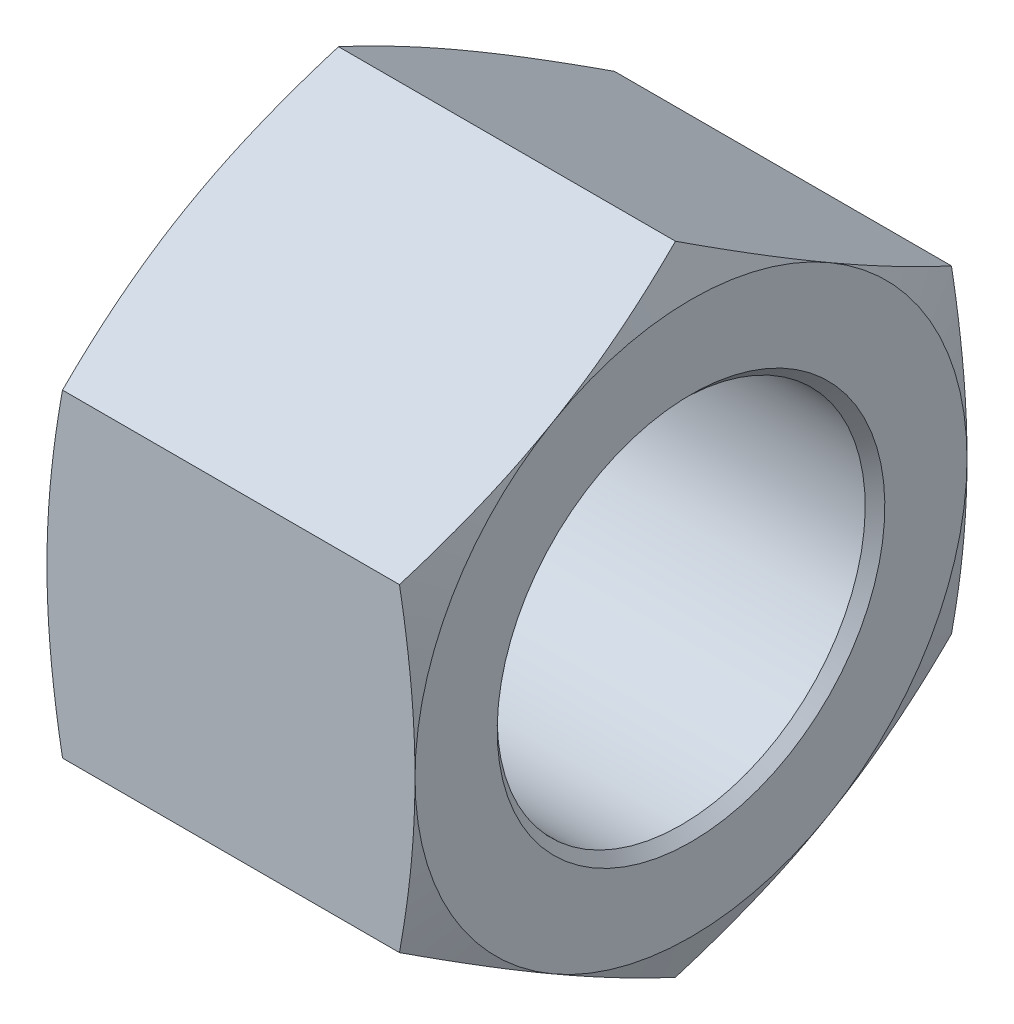
ISO-10303-21;
HEADER;
FILE_DESCRIPTION(('STEP AP214'),'2;1');
FILE_NAME('part.step','',(''),(''),'','','');
FILE_SCHEMA(('AUTOMOTIVE_DESIGN { 1 0 10303 214 1 1 1 1 }'));
ENDSEC;
DATA;
#1=APPLICATION_CONTEXT('core data for automotive mechanical design processes');
#2=APPLICATION_PROTOCOL_DEFINITION('international standard','automotive_design',2000,#1);
#3=PRODUCT_CONTEXT('',#1,'mechanical');
#4=PRODUCT('Part','Part','',(#3));
#5=PRODUCT_RELATED_PRODUCT_CATEGORY('part','',(#4));
#6=PRODUCT_DEFINITION_FORMATION('','',#4);
#7=PRODUCT_DEFINITION_CONTEXT('part definition',#1,'design');
#8=PRODUCT_DEFINITION('design','',#6,#7);
#9=PRODUCT_DEFINITION_SHAPE('','',#8);
#10=(LENGTH_UNIT() NAMED_UNIT(*) SI_UNIT(.MILLI.,.METRE.));
#11=(NAMED_UNIT(*) PLANE_ANGLE_UNIT() SI_UNIT($,.RADIAN.));
#12=(NAMED_UNIT(*) SI_UNIT($,.STERADIAN.) SOLID_ANGLE_UNIT());
#13=UNCERTAINTY_MEASURE_WITH_UNIT(LENGTH_MEASURE(1.E-05),#10,'distance_accuracy_value','');
#14=(GEOMETRIC_REPRESENTATION_CONTEXT(3) GLOBAL_UNCERTAINTY_ASSIGNED_CONTEXT((#13)) GLOBAL_UNIT_ASSIGNED_CONTEXT((#10,
#11,#12)) REPRESENTATION_CONTEXT('',''));
#15=CARTESIAN_POINT('',(0.,0.,0.));
#16=DIRECTION('',(0.,0.,1.));
#17=DIRECTION('',(1.,0.,0.));
#18=AXIS2_PLACEMENT_3D('',#15,#16,#17);
#19=CARTESIAN_POINT('',(9.525,4.12444598552339,-7.14375));
#20=DIRECTION('',(0.,-0.866025403784439,0.5));
#21=DIRECTION('',(0.,-0.5,-0.866025403784439));
#22=AXIS2_PLACEMENT_3D('',#19,#20,#21);
#23=PLANE('',#22);
#24=CARTESIAN_POINT('',(9.1227191893557,4.12433051546956,-7.14394999999999));
#25=CARTESIAN_POINT('',(9.1849126824642,4.29514240702871,-6.84809512528259));
#26=CARTESIAN_POINT('',(9.24148841339753,4.46651756023661,-6.55126465277161));
#27=CARTESIAN_POINT('',(9.34102464055038,4.81038215894262,-5.95567369688851));
#28=CARTESIAN_POINT('',(9.38397448286102,4.98287236929968,-5.65691188874185));
#29=CARTESIAN_POINT('',(9.45344461581565,5.32705284845922,-5.06077381186412));
#30=CARTESIAN_POINT('',(9.48011643058988,5.49873525708066,-4.76341115736598));
#31=CARTESIAN_POINT('',(9.51589082873939,5.84250155309196,-4.16799046674465));
#32=CARTESIAN_POINT('',(9.525,6.01458526568852,-3.86993273337232));
#33=CARTESIAN_POINT('',(9.525,6.35875269088165,-3.27381726662767));
#34=CARTESIAN_POINT('',(9.51589082873939,6.53083640347821,-2.97575953325535));
#35=CARTESIAN_POINT('',(9.48011643058988,6.87460269948951,-2.38033884263402));
#36=CARTESIAN_POINT('',(9.45344461581565,7.04628510811095,-2.08297618813587));
#37=CARTESIAN_POINT('',(9.38397448286102,7.39046558727049,-1.48683811125815));
#38=CARTESIAN_POINT('',(9.34102464055037,7.56295579762755,-1.18807630311148));
#39=CARTESIAN_POINT('',(9.24148841339753,7.90682039633356,-0.592485347228383));
#40=CARTESIAN_POINT('',(9.1849126824642,8.07819554954146,-0.295654874717405));
#41=CARTESIAN_POINT('',(9.12271918935569,8.24900744110061,0.000199999999997878));
#42=B_SPLINE_CURVE_WITH_KNOTS('',3,(#24,#25,#26,#27,#28,#29,#30,#31,#32,#33,#34,#35,#36,#37,#38,
#39,#40,#41),.UNSPECIFIED.,.F.,.F.,(4,2,2,2,2,2,2,2,4),(0.,1.04182409365374,2.08446078007893,
3.11723784735874,4.14962743643147,5.18201702550421,6.21479409278402,7.25743077920921,
8.29925487286295),.UNSPECIFIED.);
#43=CARTESIAN_POINT('',(9.1227612179007,4.1244459855234,-7.14375));
#44=VERTEX_POINT('',#43);
#45=CARTESIAN_POINT('',(9.525,6.18666897828508,-3.571875));
#46=VERTEX_POINT('',#45);
#47=EDGE_CURVE('E304',#44,#46,#42,.T.);
#48=ORIENTED_EDGE('',*,*,#47,.F.);
#49=DIRECTION('',(-1.,0.,0.));
#50=VECTOR('',#49,1.);
#51=CARTESIAN_POINT('',(9.525,4.12444598552339,-7.14375));
#52=LINE('',#51,#50);
#53=CARTESIAN_POINT('',(0.402238782099302,4.12444598552339,-7.14375));
#54=VERTEX_POINT('',#53);
#55=EDGE_CURVE('E322',#44,#54,#52,.T.);
#56=ORIENTED_EDGE('',*,*,#55,.T.);
#57=CARTESIAN_POINT('',(0.402280810644305,8.24900744110061,0.000199999999998162));
#58=CARTESIAN_POINT('',(0.340087317535802,8.07819554954146,-0.295654874717404));
#59=CARTESIAN_POINT('',(0.283511586602467,7.90682039633356,-0.592485347228383));
#60=CARTESIAN_POINT('',(0.183975359449624,7.56295579762755,-1.18807630311148));
#61=CARTESIAN_POINT('',(0.141025517138983,7.39046558727049,-1.48683811125815));
#62=CARTESIAN_POINT('',(0.0715553841843504,7.04628510811095,-2.08297618813587));
#63=CARTESIAN_POINT('',(0.044883569410118,6.87460269948951,-2.38033884263402));
#64=CARTESIAN_POINT('',(0.00910917126060439,6.53083640347821,-2.97575953325535));
#65=CARTESIAN_POINT('',(0.,6.35875269088165,-3.27381726662767));
#66=CARTESIAN_POINT('',(0.,6.01458526568852,-3.86993273337232));
#67=CARTESIAN_POINT('',(0.00910917126060452,5.84250155309196,-4.16799046674465));
#68=CARTESIAN_POINT('',(0.0448835694101182,5.49873525708066,-4.76341115736598));
#69=CARTESIAN_POINT('',(0.0715553841843507,5.32705284845922,-5.06077381186412));
#70=CARTESIAN_POINT('',(0.141025517138984,4.98287236929968,-5.65691188874185));
#71=CARTESIAN_POINT('',(0.183975359449625,4.81038215894262,-5.95567369688851));
#72=CARTESIAN_POINT('',(0.283511586602467,4.46651756023661,-6.55126465277161));
#73=CARTESIAN_POINT('',(0.340087317535802,4.29514240702871,-6.84809512528259));
#74=CARTESIAN_POINT('',(0.402280810644306,4.12433051546956,-7.14394999999999));
#75=B_SPLINE_CURVE_WITH_KNOTS('',3,(#57,#58,#59,#60,#61,#62,#63,#64,#65,#66,#67,#68,#69,#70,#71,
#72,#73,#74),.UNSPECIFIED.,.F.,.F.,(4,2,2,2,2,2,2,2,4),(0.,1.04182409365374,2.08446078007893,
3.11723784735874,4.14962743643147,5.18201702550421,6.21479409278402,7.25743077920921,
8.29925487286295),.UNSPECIFIED.);
#76=CARTESIAN_POINT('',(0.,6.18666897828508,-3.571875));
#77=VERTEX_POINT('',#76);
#78=EDGE_CURVE('E257',#77,#54,#75,.T.);
#79=ORIENTED_EDGE('',*,*,#78,.F.);
#80=CARTESIAN_POINT('',(0.4022387820993,8.24889197104678,0.));
#81=VERTEX_POINT('',#80);
#82=EDGE_CURVE('E261',#81,#77,#75,.T.);
#83=ORIENTED_EDGE('',*,*,#82,.F.);
#84=DIRECTION('',(-1.,0.,0.));
#85=VECTOR('',#84,1.);
#86=CARTESIAN_POINT('',(9.525,8.24889197104678,0.));
#87=LINE('',#86,#85);
#88=CARTESIAN_POINT('',(9.1227612179007,8.24889197104678,0.));
#89=VERTEX_POINT('',#88);
#90=EDGE_CURVE('E294',#89,#81,#87,.T.);
#91=ORIENTED_EDGE('',*,*,#90,.F.);
#92=EDGE_CURVE('E202',#46,#89,#42,.T.);
#93=ORIENTED_EDGE('',*,*,#92,.F.);
#94=EDGE_LOOP('',(#48,#56,#79,#83,#91,#93));
#95=FACE_BOUND('',#94,.T.);
#96=ADVANCED_FACE('F33',(#95),#23,.F.);
#97=CARTESIAN_POINT('',(9.525,8.24889197104678,0.));
#98=DIRECTION('',(0.,-0.866025403784439,-0.5));
#99=DIRECTION('',(0.,0.5,-0.866025403784439));
#100=AXIS2_PLACEMENT_3D('',#97,#98,#99);
#101=PLANE('',#100);
#102=CARTESIAN_POINT('',(9.12271918935569,8.24900744110062,-0.000200000000001627));
#103=CARTESIAN_POINT('',(9.1849126824642,8.07819554954146,0.295654874717401));
#104=CARTESIAN_POINT('',(9.24148841339753,7.90682039633356,0.592485347228381));
#105=CARTESIAN_POINT('',(9.34102464055037,7.56295579762755,1.18807630311148));
#106=CARTESIAN_POINT('',(9.38397448286102,7.39046558727049,1.48683811125814));
#107=CARTESIAN_POINT('',(9.45344461581565,7.04628510811095,2.08297618813587));
#108=CARTESIAN_POINT('',(9.48011643058988,6.87460269948951,2.38033884263402));
#109=CARTESIAN_POINT('',(9.51589082873939,6.53083640347821,2.97575953325535));
#110=CARTESIAN_POINT('',(9.525,6.35875269088165,3.27381726662767));
#111=CARTESIAN_POINT('',(9.525,6.01458526568852,3.86993273337233));
#112=CARTESIAN_POINT('',(9.51589082873939,5.84250155309196,4.16799046674465));
#113=CARTESIAN_POINT('',(9.48011643058988,5.49873525708066,4.76341115736598));
#114=CARTESIAN_POINT('',(9.45344461581565,5.32705284845922,5.06077381186413));
#115=CARTESIAN_POINT('',(9.38397448286102,4.98287236929967,5.65691188874186));
#116=CARTESIAN_POINT('',(9.34102464055037,4.81038215894262,5.95567369688852));
#117=CARTESIAN_POINT('',(9.24148841339753,4.46651756023661,6.55126465277162));
#118=CARTESIAN_POINT('',(9.1849126824642,4.29514240702871,6.8480951252826));
#119=CARTESIAN_POINT('',(9.12271918935569,4.12433051546955,7.14395));
#120=B_SPLINE_CURVE_WITH_KNOTS('',3,(#102,#103,#104,#105,#106,#107,#108,#109,#110,#111,#112,
#113,#114,#115,#116,#117,#118,#119),.UNSPECIFIED.,.F.,.F.,(4,2,2,2,2,2,2,2,4),(0.,
1.04182409365374,2.08446078007893,3.11723784735874,4.14962743643148,5.18201702550422,
6.21479409278403,7.25743077920922,8.29925487286296),.UNSPECIFIED.);
#121=CARTESIAN_POINT('',(9.525,6.18666897828509,3.57187499999999));
#122=VERTEX_POINT('',#121);
#123=EDGE_CURVE('E200',#89,#122,#120,.T.);
#124=ORIENTED_EDGE('',*,*,#123,.F.);
#125=ORIENTED_EDGE('',*,*,#90,.T.);
#126=CARTESIAN_POINT('',(0.402280810644308,4.12433051546955,7.14395));
#127=CARTESIAN_POINT('',(0.340087317535804,4.29514240702871,6.8480951252826));
#128=CARTESIAN_POINT('',(0.283511586602469,4.46651756023661,6.55126465277162));
#129=CARTESIAN_POINT('',(0.183975359449626,4.81038215894262,5.95567369688852));
#130=CARTESIAN_POINT('',(0.141025517138984,4.98287236929967,5.65691188874186));
#131=CARTESIAN_POINT('',(0.071555384184351,5.32705284845922,5.06077381186413));
#132=CARTESIAN_POINT('',(0.0448835694101186,5.49873525708066,4.76341115736598));
#133=CARTESIAN_POINT('',(0.00910917126060477,5.84250155309196,4.16799046674465));
#134=CARTESIAN_POINT('',(0.,6.01458526568852,3.86993273337233));
#135=CARTESIAN_POINT('',(0.,6.35875269088165,3.27381726662767));
#136=CARTESIAN_POINT('',(0.00910917126060422,6.53083640347821,2.97575953325535));
#137=CARTESIAN_POINT('',(0.0448835694101178,6.87460269948951,2.38033884263402));
#138=CARTESIAN_POINT('',(0.0715553841843502,7.04628510811095,2.08297618813587));
#139=CARTESIAN_POINT('',(0.141025517138983,7.39046558727049,1.48683811125814));
#140=CARTESIAN_POINT('',(0.183975359449624,7.56295579762755,1.18807630311148));
#141=CARTESIAN_POINT('',(0.283511586602467,7.90682039633356,0.59248534722838));
#142=CARTESIAN_POINT('',(0.340087317535802,8.07819554954146,0.295654874717401));
#143=CARTESIAN_POINT('',(0.402280810644306,8.24900744110062,-0.000200000000002111));
#144=B_SPLINE_CURVE_WITH_KNOTS('',3,(#126,#127,#128,#129,#130,#131,#132,#133,#134,#135,#136,
#137,#138,#139,#140,#141,#142,#143),.UNSPECIFIED.,.F.,.F.,(4,2,2,2,2,2,2,2,4),(0.,
1.04182409365374,2.08446078007893,3.11723784735874,4.14962743643148,5.18201702550422,
6.21479409278403,7.25743077920922,8.29925487286296),.UNSPECIFIED.);
#145=CARTESIAN_POINT('',(0.,6.18666897828509,3.571875));
#146=VERTEX_POINT('',#145);
#147=EDGE_CURVE('E215',#146,#81,#144,.T.);
#148=ORIENTED_EDGE('',*,*,#147,.F.);
#149=CARTESIAN_POINT('',(0.402238782099302,4.12444598552338,7.14375));
#150=VERTEX_POINT('',#149);
#151=EDGE_CURVE('E222',#150,#146,#144,.T.);
#152=ORIENTED_EDGE('',*,*,#151,.F.);
#153=DIRECTION('',(-1.,0.,0.));
#154=VECTOR('',#153,1.);
#155=CARTESIAN_POINT('',(9.525,4.12444598552339,7.14375));
#156=LINE('',#155,#154);
#157=CARTESIAN_POINT('',(9.1227612179007,4.12444598552338,7.14375));
#158=VERTEX_POINT('',#157);
#159=EDGE_CURVE('E314',#158,#150,#156,.T.);
#160=ORIENTED_EDGE('',*,*,#159,.F.);
#161=EDGE_CURVE('E196',#122,#158,#120,.T.);
#162=ORIENTED_EDGE('',*,*,#161,.F.);
#163=EDGE_LOOP('',(#124,#125,#148,#152,#160,#162));
#164=FACE_BOUND('',#163,.T.);
#165=ADVANCED_FACE('F207',(#164),#101,.F.);
#166=CARTESIAN_POINT('',(9.525,4.12444598552339,7.14375));
#167=DIRECTION('',(0.,0.,-1.));
#168=DIRECTION('',(-1.,0.,0.));
#169=AXIS2_PLACEMENT_3D('',#166,#167,#168);
#170=PLANE('',#169);
#171=CARTESIAN_POINT('',(7.3755954676901,-10.9200827147679,7.14375));
#172=CARTESIAN_POINT('',(7.47401251114615,-10.5968736314427,7.14375));
#173=CARTESIAN_POINT('',(7.57128115583758,-10.2733083598642,7.14375));
#174=CARTESIAN_POINT('',(7.76288635518501,-9.62528410275324,7.14375));
#175=CARTESIAN_POINT('',(7.85722267782338,-9.30082504870096,7.14375));
#176=CARTESIAN_POINT('',(8.0424848681459,-8.65027654273222,7.14375));
#177=CARTESIAN_POINT('',(8.13340404438387,-8.32418517835007,7.14375));
#178=CARTESIAN_POINT('',(8.31076752613789,-7.6707894265508,7.14375));
#179=CARTESIAN_POINT('',(8.39721191199983,-7.34348506102655,7.14375));
#180=CARTESIAN_POINT('',(8.56348618493307,-6.69148973208795,7.14375));
#181=CARTESIAN_POINT('',(8.6433844844259,-6.36681630234357,7.14375));
#182=CARTESIAN_POINT('',(8.79637870102756,-5.71585382602452,7.14375));
#183=CARTESIAN_POINT('',(8.86947450366048,-5.38956475235824,7.14375));
#184=CARTESIAN_POINT('',(9.00715956615598,-4.73529797771662,7.14375));
#185=CARTESIAN_POINT('',(9.07175172771729,-4.40732089264437,7.14375));
#186=CARTESIAN_POINT('',(9.19046269714445,-3.74946258820886,7.14375));
#187=CARTESIAN_POINT('',(9.24458185591649,-3.41958143302449,7.14375));
#188=CARTESIAN_POINT('',(9.33478964865835,-2.79506090172699,7.14375));
#189=CARTESIAN_POINT('',(9.37221953324854,-2.50061708178008,7.14375));
#190=CARTESIAN_POINT('',(9.43557941092575,-1.91048438735558,7.14375));
#191=CARTESIAN_POINT('',(9.46150973912172,-1.61479554941263,7.14375));
#192=CARTESIAN_POINT('',(9.5006217524448,-1.02277258498837,7.14375));
#193=CARTESIAN_POINT('',(9.51381245487754,-0.726439063946467,7.14375));
#194=CARTESIAN_POINT('',(9.52677737403611,-0.13347554661258,7.14375));
#195=CARTESIAN_POINT('',(9.5265516855081,0.163154447570928,7.14375));
#196=CARTESIAN_POINT('',(9.51266094939001,0.757599550813985,7.14375));
#197=CARTESIAN_POINT('',(9.49892774984047,1.05541304081946,7.14375));
#198=CARTESIAN_POINT('',(9.45865399683557,1.65016526826794,7.14375));
#199=CARTESIAN_POINT('',(9.43211313568459,1.94710398452264,7.14375));
#200=CARTESIAN_POINT('',(9.36746562869702,2.53996004102374,7.14375));
#201=CARTESIAN_POINT('',(9.3293490488025,2.83587628232483,7.14375));
#202=CARTESIAN_POINT('',(9.24309621441296,3.42622836693684,7.14375));
#203=CARTESIAN_POINT('',(9.19495990621529,3.72066420230458,7.14375));
#204=CARTESIAN_POINT('',(9.08746427609924,4.32354944457742,7.14375));
#205=CARTESIAN_POINT('',(9.02764598697369,4.63191628737276,7.14375));
#206=CARTESIAN_POINT('',(8.90031041281534,5.24706642900888,7.14375));
#207=CARTESIAN_POINT('',(8.83279254734769,5.55384960663995,7.14375));
#208=CARTESIAN_POINT('',(8.69147566748789,6.16605106932829,7.14375));
#209=CARTESIAN_POINT('',(8.61767482891231,6.47146893070712,7.14375));
#210=CARTESIAN_POINT('',(8.46499211916294,7.08101794740676,7.14375));
#211=CARTESIAN_POINT('',(8.38611036977709,7.38514913338272,7.14375));
#212=CARTESIAN_POINT('',(8.22411351250143,7.9926947026574,7.14375));
#213=CARTESIAN_POINT('',(8.14099311918675,8.29610767165621,7.14375));
#214=CARTESIAN_POINT('',(7.97136566457326,8.90198721551974,7.14375));
#215=CARTESIAN_POINT('',(7.88485855340292,9.20445377637713,7.14375));
#216=CARTESIAN_POINT('',(7.62122854002771,10.1105383213636,7.14375));
#217=CARTESIAN_POINT('',(7.4399670672183,10.7129513695015,7.14375));
#218=CARTESIAN_POINT('',(7.07192148188703,11.9087936075579,7.14375));
#219=CARTESIAN_POINT('',(6.88522041109715,12.5022485655621,7.14375));
#220=CARTESIAN_POINT('',(6.50651407512142,13.6874914933361,7.14375));
#221=CARTESIAN_POINT('',(6.3145085554472,14.2792793816195,7.14375));
#222=CARTESIAN_POINT('',(5.92735695069108,15.459337282081,7.14375));
#223=CARTESIAN_POINT('',(5.73222554627461,16.0476121223004,7.14375));
#224=CARTESIAN_POINT('',(5.43736295643888,16.9292722585656,7.14375));
#225=CARTESIAN_POINT('',(5.33871852988799,17.2230217987937,7.14375));
#226=CARTESIAN_POINT('',(5.1407913796115,17.8103049969963,7.14375));
#227=CARTESIAN_POINT('',(5.04150865744177,18.1038386554951,7.14375));
#228=CARTESIAN_POINT('',(4.94194957334921,18.3972785363047,7.14375));
#229=B_SPLINE_CURVE_WITH_KNOTS('',3,(#171,#172,#173,#174,#175,#176,#177,#178,#179,#180,#181,
#182,#183,#184,#185,#186,#187,#188,#189,#190,#191,#192,#193,#194,#195,#196,#197,#198,#199,#200,
#201,#202,#203,#204,#205,#206,#207,#208,#209,#210,#211,#212,#213,#214,#215,#216,#217,#218,#219,
#220,#221,#222,#223,#224,#225,#226,#227,#228),.UNSPECIFIED.,.F.,.F.,(4,2,2,2,2,2,2,2,2,2,2,2,2,
2,2,2,2,2,2,2,2,2,2,2,2,2,2,2,4),(0.,1.01359005049056,2.02726009738559,3.04282139996046,
4.05836446156959,5.06138639910424,6.0644252129549,7.06712086765491,8.06978292043059,
8.96002745474091,9.85024604470128,10.7398340612719,11.629415795599,12.5235090473126,
13.4176237800953,14.3125080035893,15.2073970235093,16.1496220096912,17.0919180727965,
18.0344886590554,18.9770366605774,19.920790180374,20.8645576027592,22.7517499572862,
24.6181117995847,26.484563339238,28.3439329328648,29.2735428384815,30.2031504789955),.UNSPECIFIED.);
#230=CARTESIAN_POINT('',(9.525,0.,7.14375));
#231=VERTEX_POINT('',#230);
#232=EDGE_CURVE('E201',#158,#231,#229,.F.);
#233=ORIENTED_EDGE('',*,*,#232,.F.);
#234=ORIENTED_EDGE('',*,*,#159,.T.);
#235=CARTESIAN_POINT('',(2.14940453230992,-10.9200827147679,7.14375));
#236=CARTESIAN_POINT('',(2.05098748885386,-10.5968736314427,7.14375));
#237=CARTESIAN_POINT('',(1.95371884416244,-10.2733083598642,7.14375));
#238=CARTESIAN_POINT('',(1.762113644815,-9.62528410275323,7.14375));
#239=CARTESIAN_POINT('',(1.66777732217663,-9.30082504870096,7.14375));
#240=CARTESIAN_POINT('',(1.48251513185412,-8.65027654273222,7.14375));
#241=CARTESIAN_POINT('',(1.39159595561614,-8.32418517835007,7.14375));
#242=CARTESIAN_POINT('',(1.21423247386212,-7.6707894265508,7.14375));
#243=CARTESIAN_POINT('',(1.12778808800018,-7.34348506102655,7.14375));
#244=CARTESIAN_POINT('',(0.961513815066938,-6.69148973208795,7.14375));
#245=CARTESIAN_POINT('',(0.881615515574106,-6.36681630234357,7.14375));
#246=CARTESIAN_POINT('',(0.72862129897245,-5.71585382602452,7.14375));
#247=CARTESIAN_POINT('',(0.655525496339531,-5.38956475235824,7.14375));
#248=CARTESIAN_POINT('',(0.517840433844024,-4.73529797771661,7.14375));
#249=CARTESIAN_POINT('',(0.453248272282719,-4.40732089264436,7.14375));
#250=CARTESIAN_POINT('',(0.334537302855556,-3.74946258820885,7.14375));
#251=CARTESIAN_POINT('',(0.280418144083515,-3.41958143302448,7.14375));
#252=CARTESIAN_POINT('',(0.190210351341649,-2.79506090172699,7.14375));
#253=CARTESIAN_POINT('',(0.152780466751466,-2.50061708178008,7.14375));
#254=CARTESIAN_POINT('',(0.0894205890742566,-1.91048438735558,7.14375));
#255=CARTESIAN_POINT('',(0.0634902608782825,-1.61479554941263,7.14375));
#256=CARTESIAN_POINT('',(0.0243782475552002,-1.02277258498837,7.14375));
#257=CARTESIAN_POINT('',(0.0111875451224659,-0.72643906394647,7.14375));
#258=CARTESIAN_POINT('',(-0.00177737403610836,-0.133475546612586,7.14375));
#259=CARTESIAN_POINT('',(-0.00155168550810396,0.163154447570921,7.14375));
#260=CARTESIAN_POINT('',(0.0123390506099932,0.757599550813975,7.14375));
#261=CARTESIAN_POINT('',(0.0260722501595279,1.05541304081945,7.14375));
#262=CARTESIAN_POINT('',(0.0663460031644316,1.65016526826792,7.14375));
#263=CARTESIAN_POINT('',(0.0928868643154085,1.94710398452262,7.14375));
#264=CARTESIAN_POINT('',(0.157534371302983,2.53996004102372,7.14375));
#265=CARTESIAN_POINT('',(0.1956509511975,2.83587628232481,7.14375));
#266=CARTESIAN_POINT('',(0.281903785587038,3.42622836693682,7.14375));
#267=CARTESIAN_POINT('',(0.330040093784703,3.72066420230456,7.14375));
#268=CARTESIAN_POINT('',(0.437535723900757,4.32354944457739,7.14375));
#269=CARTESIAN_POINT('',(0.497354013026304,4.63191628737274,7.14375));
#270=CARTESIAN_POINT('',(0.624689587184656,5.24706642900885,7.14375));
#271=CARTESIAN_POINT('',(0.692207452652307,5.55384960663992,7.14375));
#272=CARTESIAN_POINT('',(0.833524332512108,6.16605106932826,7.14375));
#273=CARTESIAN_POINT('',(0.907325171087688,6.47146893070709,7.14375));
#274=CARTESIAN_POINT('',(1.06000788083705,7.08101794740673,7.14375));
#275=CARTESIAN_POINT('',(1.1388896302229,7.38514913338269,7.14375));
#276=CARTESIAN_POINT('',(1.30088648749856,7.99269470265736,7.14375));
#277=CARTESIAN_POINT('',(1.38400688081324,8.29610767165617,7.14375));
#278=CARTESIAN_POINT('',(1.55363433542674,8.90198721551971,7.14375));
#279=CARTESIAN_POINT('',(1.64014144659707,9.2044537763771,7.14375));
#280=CARTESIAN_POINT('',(1.90377145997228,10.1105383213636,7.14375));
#281=CARTESIAN_POINT('',(2.08503293278169,10.7129513695015,7.14375));
#282=CARTESIAN_POINT('',(2.45307851811296,11.9087936075578,7.14375));
#283=CARTESIAN_POINT('',(2.63977958890284,12.5022485655621,7.14375));
#284=CARTESIAN_POINT('',(3.01848592487858,13.687491493336,7.14375));
#285=CARTESIAN_POINT('',(3.21049144455279,14.2792793816195,7.14375));
#286=CARTESIAN_POINT('',(3.59764304930891,15.459337282081,7.14375));
#287=CARTESIAN_POINT('',(3.79277445372539,16.0476121223004,7.14375));
#288=CARTESIAN_POINT('',(4.08763704356112,16.9292722585656,7.14375));
#289=CARTESIAN_POINT('',(4.18628147011201,17.2230217987937,7.14375));
#290=CARTESIAN_POINT('',(4.3842086203885,17.8103049969963,7.14375));
#291=CARTESIAN_POINT('',(4.48349134255823,18.1038386554951,7.14375));
#292=CARTESIAN_POINT('',(4.58305042665079,18.3972785363046,7.14375));
#293=B_SPLINE_CURVE_WITH_KNOTS('',3,(#235,#236,#237,#238,#239,#240,#241,#242,#243,#244,#245,
#246,#247,#248,#249,#250,#251,#252,#253,#254,#255,#256,#257,#258,#259,#260,#261,#262,#263,#264,
#265,#266,#267,#268,#269,#270,#271,#272,#273,#274,#275,#276,#277,#278,#279,#280,#281,#282,#283,
#284,#285,#286,#287,#288,#289,#290,#291,#292),.UNSPECIFIED.,.F.,.F.,(4,2,2,2,2,2,2,2,2,2,2,2,2,
2,2,2,2,2,2,2,2,2,2,2,2,2,2,2,4),(0.,1.01359005049056,2.02726009738559,3.04282139996046,
4.05836446156959,5.06138639910424,6.0644252129549,7.06712086765491,8.0697829204306,
8.9600274547409,9.85024604470128,10.7398340612719,11.629415795599,12.5235090473126,
13.4176237800953,14.3125080035893,15.2073970235093,16.1496220096911,17.0919180727964,
18.0344886590553,18.9770366605774,19.9207901803739,20.8645576027592,22.7517499572861,
24.6181117995847,26.484563339238,28.3439329328647,29.2735428384815,30.2031504789955),.UNSPECIFIED.);
#294=CARTESIAN_POINT('',(0.,0.,7.14375));
#295=VERTEX_POINT('',#294);
#296=EDGE_CURVE('E228',#295,#150,#293,.T.);
#297=ORIENTED_EDGE('',*,*,#296,.F.);
#298=CARTESIAN_POINT('',(0.402238782099305,-4.12444598552339,7.14375));
#299=VERTEX_POINT('',#298);
#300=EDGE_CURVE('E284',#299,#295,#293,.T.);
#301=ORIENTED_EDGE('',*,*,#300,.F.);
#302=DIRECTION('',(-1.,0.,0.));
#303=VECTOR('',#302,1.);
#304=CARTESIAN_POINT('',(9.525,-4.12444598552339,7.14375));
#305=LINE('',#304,#303);
#306=CARTESIAN_POINT('',(9.1227612179007,-4.12444598552339,7.14374999999999));
#307=VERTEX_POINT('',#306);
#308=EDGE_CURVE('E316',#307,#299,#305,.T.);
#309=ORIENTED_EDGE('',*,*,#308,.F.);
#310=EDGE_CURVE('E131',#231,#307,#229,.F.);
#311=ORIENTED_EDGE('',*,*,#310,.F.);
#312=EDGE_LOOP('',(#233,#234,#297,#301,#309,#311));
#313=FACE_BOUND('',#312,.T.);
#314=ADVANCED_FACE('F210',(#313),#170,.F.);
#315=CARTESIAN_POINT('',(9.525,-4.12444598552339,7.14375));
#316=DIRECTION('',(0.,0.866025403784439,-0.5));
#317=DIRECTION('',(0.,0.5,0.866025403784438));
#318=AXIS2_PLACEMENT_3D('',#315,#316,#317);
#319=PLANE('',#318);
#320=CARTESIAN_POINT('',(9.1227191893557,-4.12433051546955,7.14395));
#321=CARTESIAN_POINT('',(9.1849126824642,-4.29514240702871,6.8480951252826));
#322=CARTESIAN_POINT('',(9.24148841339753,-4.4665175602366,6.55126465277162));
#323=CARTESIAN_POINT('',(9.34102464055038,-4.81038215894262,5.95567369688852));
#324=CARTESIAN_POINT('',(9.38397448286102,-4.98287236929967,5.65691188874186));
#325=CARTESIAN_POINT('',(9.45344461581565,-5.32705284845922,5.06077381186413));
#326=CARTESIAN_POINT('',(9.48011643058988,-5.49873525708066,4.76341115736599));
#327=CARTESIAN_POINT('',(9.5158908287394,-5.84250155309196,4.16799046674466));
#328=CARTESIAN_POINT('',(9.525,-6.01458526568852,3.86993273337233));
#329=CARTESIAN_POINT('',(9.525,-6.35875269088165,3.27381726662768));
#330=CARTESIAN_POINT('',(9.5158908287394,-6.53083640347821,2.97575953325535));
#331=CARTESIAN_POINT('',(9.48011643058988,-6.87460269948951,2.38033884263402));
#332=CARTESIAN_POINT('',(9.45344461581565,-7.04628510811095,2.08297618813588));
#333=CARTESIAN_POINT('',(9.38397448286102,-7.39046558727049,1.48683811125815));
#334=CARTESIAN_POINT('',(9.34102464055038,-7.56295579762755,1.18807630311149));
#335=CARTESIAN_POINT('',(9.24148841339754,-7.90682039633356,0.592485347228388));
#336=CARTESIAN_POINT('',(9.1849126824642,-8.07819554954146,0.295654874717409));
#337=CARTESIAN_POINT('',(9.1227191893557,-8.24900744110061,-0.00019999999999377));
#338=B_SPLINE_CURVE_WITH_KNOTS('',3,(#320,#321,#322,#323,#324,#325,#326,#327,#328,#329,#330,
#331,#332,#333,#334,#335,#336,#337),.UNSPECIFIED.,.F.,.F.,(4,2,2,2,2,2,2,2,4),(0.,
1.04182409365374,2.08446078007893,3.11723784735874,4.14962743643148,5.18201702550421,
6.21479409278402,7.25743077920921,8.29925487286295),.UNSPECIFIED.);
#339=CARTESIAN_POINT('',(9.525,-6.18666897828508,3.571875));
#340=VERTEX_POINT('',#339);
#341=EDGE_CURVE('E124',#307,#340,#338,.T.);
#342=ORIENTED_EDGE('',*,*,#341,.F.);
#343=ORIENTED_EDGE('',*,*,#308,.T.);
#344=CARTESIAN_POINT('',(0.402280810644312,-8.24900744110062,-0.000199999999996206));
#345=CARTESIAN_POINT('',(0.340087317535808,-8.07819554954146,0.295654874717406));
#346=CARTESIAN_POINT('',(0.283511586602473,-7.90682039633356,0.592485347228386));
#347=CARTESIAN_POINT('',(0.18397535944963,-7.56295579762755,1.18807630311149));
#348=CARTESIAN_POINT('',(0.141025517138989,-7.39046558727049,1.48683811125815));
#349=CARTESIAN_POINT('',(0.0715553841843556,-7.04628510811095,2.08297618813588));
#350=CARTESIAN_POINT('',(0.0448835694101231,-6.87460269948951,2.38033884263402));
#351=CARTESIAN_POINT('',(0.00910917126060926,-6.53083640347821,2.97575953325535));
#352=CARTESIAN_POINT('',(0.,-6.35875269088165,3.27381726662768));
#353=CARTESIAN_POINT('',(0.,-6.01458526568852,3.86993273337233));
#354=CARTESIAN_POINT('',(0.00910917126060901,-5.84250155309196,4.16799046674466));
#355=CARTESIAN_POINT('',(0.0448835694101228,-5.49873525708066,4.76341115736599));
#356=CARTESIAN_POINT('',(0.0715553841843552,-5.32705284845922,5.06077381186413));
#357=CARTESIAN_POINT('',(0.141025517138988,-4.98287236929967,5.65691188874186));
#358=CARTESIAN_POINT('',(0.183975359449629,-4.81038215894262,5.95567369688852));
#359=CARTESIAN_POINT('',(0.283511586602472,-4.4665175602366,6.55126465277162));
#360=CARTESIAN_POINT('',(0.340087317535807,-4.29514240702871,6.8480951252826));
#361=CARTESIAN_POINT('',(0.402280810644311,-4.12433051546955,7.14395));
#362=B_SPLINE_CURVE_WITH_KNOTS('',3,(#344,#345,#346,#347,#348,#349,#350,#351,#352,#353,#354,
#355,#356,#357,#358,#359,#360,#361),.UNSPECIFIED.,.F.,.F.,(4,2,2,2,2,2,2,2,4),(0.,
1.04182409365374,2.08446078007893,3.11723784735874,4.14962743643148,5.18201702550422,
6.21479409278402,7.25743077920922,8.29925487286295),.UNSPECIFIED.);
#363=CARTESIAN_POINT('',(0.,-6.18666897828508,3.571875));
#364=VERTEX_POINT('',#363);
#365=EDGE_CURVE('E278',#364,#299,#362,.T.);
#366=ORIENTED_EDGE('',*,*,#365,.F.);
#367=CARTESIAN_POINT('',(0.402238782099306,-8.24889197104678,0.));
#368=VERTEX_POINT('',#367);
#369=EDGE_CURVE('E223',#368,#364,#362,.T.);
#370=ORIENTED_EDGE('',*,*,#369,.F.);
#371=DIRECTION('',(-1.,0.,0.));
#372=VECTOR('',#371,1.);
#373=CARTESIAN_POINT('',(9.525,-8.24889197104678,0.));
#374=LINE('',#373,#372);
#375=CARTESIAN_POINT('',(9.1227612179007,-8.24889197104677,0.));
#376=VERTEX_POINT('',#375);
#377=EDGE_CURVE('E152',#376,#368,#374,.T.);
#378=ORIENTED_EDGE('',*,*,#377,.F.);
#379=EDGE_CURVE('E135',#340,#376,#338,.T.);
#380=ORIENTED_EDGE('',*,*,#379,.F.);
#381=EDGE_LOOP('',(#342,#343,#366,#370,#378,#380));
#382=FACE_BOUND('',#381,.T.);
#383=ADVANCED_FACE('F150',(#382),#319,.F.);
#384=CARTESIAN_POINT('',(9.525,-8.24889197104678,0.));
#385=DIRECTION('',(0.,0.866025403784439,0.5));
#386=DIRECTION('',(0.,-0.5,0.866025403784439));
#387=AXIS2_PLACEMENT_3D('',#384,#385,#386);
#388=PLANE('',#387);
#389=CARTESIAN_POINT('',(9.1227191893557,-8.24900744110062,0.000200000000003583));
#390=CARTESIAN_POINT('',(9.1849126824642,-8.07819554954146,-0.295654874717398));
#391=CARTESIAN_POINT('',(9.24148841339754,-7.90682039633356,-0.592485347228378));
#392=CARTESIAN_POINT('',(9.34102464055038,-7.56295579762755,-1.18807630311148));
#393=CARTESIAN_POINT('',(9.38397448286102,-7.3904655872705,-1.48683811125814));
#394=CARTESIAN_POINT('',(9.45344461581565,-7.04628510811095,-2.08297618813587));
#395=CARTESIAN_POINT('',(9.48011643058988,-6.87460269948951,-2.38033884263401));
#396=CARTESIAN_POINT('',(9.5158908287394,-6.53083640347821,-2.97575953325534));
#397=CARTESIAN_POINT('',(9.525,-6.35875269088165,-3.27381726662767));
#398=CARTESIAN_POINT('',(9.525,-6.01458526568852,-3.86993273337232));
#399=CARTESIAN_POINT('',(9.5158908287394,-5.84250155309196,-4.16799046674465));
#400=CARTESIAN_POINT('',(9.48011643058988,-5.49873525708066,-4.76341115736598));
#401=CARTESIAN_POINT('',(9.45344461581565,-5.32705284845922,-5.06077381186412));
#402=CARTESIAN_POINT('',(9.38397448286102,-4.98287236929968,-5.65691188874185));
#403=CARTESIAN_POINT('',(9.34102464055038,-4.81038215894262,-5.95567369688851));
#404=CARTESIAN_POINT('',(9.24148841339754,-4.46651756023661,-6.55126465277161));
#405=CARTESIAN_POINT('',(9.1849126824642,-4.29514240702871,-6.84809512528259));
#406=CARTESIAN_POINT('',(9.1227191893557,-4.12433051546956,-7.14394999999999));
#407=B_SPLINE_CURVE_WITH_KNOTS('',3,(#389,#390,#391,#392,#393,#394,#395,#396,#397,#398,#399,
#400,#401,#402,#403,#404,#405,#406),.UNSPECIFIED.,.F.,.F.,(4,2,2,2,2,2,2,2,4),(0.,
1.04182409365374,2.08446078007893,3.11723784735874,4.14962743643148,5.18201702550421,
6.21479409278402,7.25743077920922,8.29925487286295),.UNSPECIFIED.);
#408=CARTESIAN_POINT('',(9.525,-6.18666897828508,-3.571875));
#409=VERTEX_POINT('',#408);
#410=EDGE_CURVE('E141',#376,#409,#407,.T.);
#411=ORIENTED_EDGE('',*,*,#410,.F.);
#412=ORIENTED_EDGE('',*,*,#377,.T.);
#413=CARTESIAN_POINT('',(0.402280810644309,-4.12433051546955,-7.14394999999999));
#414=CARTESIAN_POINT('',(0.340087317535806,-4.29514240702871,-6.84809512528259));
#415=CARTESIAN_POINT('',(0.283511586602471,-4.46651756023661,-6.55126465277161));
#416=CARTESIAN_POINT('',(0.183975359449628,-4.81038215894262,-5.95567369688851));
#417=CARTESIAN_POINT('',(0.141025517138987,-4.98287236929968,-5.65691188874185));
#418=CARTESIAN_POINT('',(0.071555384184354,-5.32705284845922,-5.06077381186412));
#419=CARTESIAN_POINT('',(0.0448835694101217,-5.49873525708066,-4.76341115736598));
#420=CARTESIAN_POINT('',(0.00910917126060833,-5.84250155309196,-4.16799046674465));
#421=CARTESIAN_POINT('',(0.,-6.01458526568852,-3.86993273337232));
#422=CARTESIAN_POINT('',(0.,-6.35875269088165,-3.27381726662767));
#423=CARTESIAN_POINT('',(0.00910917126060854,-6.53083640347821,-2.97575953325534));
#424=CARTESIAN_POINT('',(0.0448835694101225,-6.87460269948951,-2.38033884263401));
#425=CARTESIAN_POINT('',(0.0715553841843552,-7.04628510811095,-2.08297618813587));
#426=CARTESIAN_POINT('',(0.141025517138989,-7.3904655872705,-1.48683811125814));
#427=CARTESIAN_POINT('',(0.18397535944963,-7.56295579762755,-1.18807630311148));
#428=CARTESIAN_POINT('',(0.283511586602473,-7.90682039633356,-0.592485347228378));
#429=CARTESIAN_POINT('',(0.340087317535808,-8.07819554954146,-0.295654874717399));
#430=CARTESIAN_POINT('',(0.402280810644312,-8.24900744110062,0.000200000000004338));
#431=B_SPLINE_CURVE_WITH_KNOTS('',3,(#413,#414,#415,#416,#417,#418,#419,#420,#421,#422,#423,
#424,#425,#426,#427,#428,#429,#430),.UNSPECIFIED.,.F.,.F.,(4,2,2,2,2,2,2,2,4),(0.,
1.04182409365374,2.08446078007893,3.11723784735874,4.14962743643148,5.18201702550421,
6.21479409278402,7.25743077920922,8.29925487286295),.UNSPECIFIED.);
#432=CARTESIAN_POINT('',(0.,-6.18666897828508,-3.571875));
#433=VERTEX_POINT('',#432);
#434=EDGE_CURVE('E264',#433,#368,#431,.T.);
#435=ORIENTED_EDGE('',*,*,#434,.F.);
#436=CARTESIAN_POINT('',(0.402238782099305,-4.12444598552339,-7.14375));
#437=VERTEX_POINT('',#436);
#438=EDGE_CURVE('E252',#437,#433,#431,.T.);
#439=ORIENTED_EDGE('',*,*,#438,.F.);
#440=DIRECTION('',(-1.,0.,0.));
#441=VECTOR('',#440,1.);
#442=CARTESIAN_POINT('',(9.525,-4.12444598552339,-7.14375));
#443=LINE('',#442,#441);
#444=CARTESIAN_POINT('',(9.1227612179007,-4.12444598552339,-7.14375));
#445=VERTEX_POINT('',#444);
#446=EDGE_CURVE('E321',#445,#437,#443,.T.);
#447=ORIENTED_EDGE('',*,*,#446,.F.);
#448=EDGE_CURVE('E153',#409,#445,#407,.T.);
#449=ORIENTED_EDGE('',*,*,#448,.F.);
#450=EDGE_LOOP('',(#411,#412,#435,#439,#447,#449));
#451=FACE_BOUND('',#450,.T.);
#452=ADVANCED_FACE('F329',(#451),#388,.F.);
#453=CARTESIAN_POINT('',(9.525,-4.12444598552339,-7.14375));
#454=DIRECTION('',(0.,0.,1.));
#455=DIRECTION('',(1.,0.,0.));
#456=AXIS2_PLACEMENT_3D('',#453,#454,#455);
#457=PLANE('',#456);
#458=CARTESIAN_POINT('',(7.3755954676901,-10.9200827147679,-7.14375));
#459=CARTESIAN_POINT('',(7.47401251114615,-10.5968736314427,-7.14375));
#460=CARTESIAN_POINT('',(7.57128115583758,-10.2733083598642,-7.14375));
#461=CARTESIAN_POINT('',(7.76288635518502,-9.62528410275323,-7.14375));
#462=CARTESIAN_POINT('',(7.85722267782338,-9.30082504870096,-7.14375));
#463=CARTESIAN_POINT('',(8.0424848681459,-8.65027654273222,-7.14375));
#464=CARTESIAN_POINT('',(8.13340404438387,-8.32418517835007,-7.14375));
#465=CARTESIAN_POINT('',(8.3107675261379,-7.67078942655079,-7.14375));
#466=CARTESIAN_POINT('',(8.39721191199983,-7.34348506102655,-7.14375));
#467=CARTESIAN_POINT('',(8.56348618493307,-6.69148973208795,-7.14375));
#468=CARTESIAN_POINT('',(8.64338448442591,-6.36681630234357,-7.14375));
#469=CARTESIAN_POINT('',(8.79637870102756,-5.71585382602452,-7.14375));
#470=CARTESIAN_POINT('',(8.86947450366048,-5.38956475235824,-7.14375));
#471=CARTESIAN_POINT('',(9.00715956615598,-4.73529797771662,-7.14375));
#472=CARTESIAN_POINT('',(9.07175172771729,-4.40732089264437,-7.14375));
#473=CARTESIAN_POINT('',(9.19046269714445,-3.74946258820886,-7.14375));
#474=CARTESIAN_POINT('',(9.24458185591649,-3.41958143302449,-7.14375));
#475=CARTESIAN_POINT('',(9.33478964865836,-2.795060901727,-7.14375));
#476=CARTESIAN_POINT('',(9.37221953324854,-2.50061708178008,-7.14375));
#477=CARTESIAN_POINT('',(9.43557941092575,-1.91048438735558,-7.14375));
#478=CARTESIAN_POINT('',(9.46150973912172,-1.61479554941263,-7.14375));
#479=CARTESIAN_POINT('',(9.50062175244481,-1.02277258498837,-7.14375));
#480=CARTESIAN_POINT('',(9.51381245487754,-0.726439063946467,-7.14375));
#481=CARTESIAN_POINT('',(9.52677737403611,-0.13347554661258,-7.14375));
#482=CARTESIAN_POINT('',(9.52655168550811,0.163154447570928,-7.14375));
#483=CARTESIAN_POINT('',(9.51266094939001,0.757599550813984,-7.14375));
#484=CARTESIAN_POINT('',(9.49892774984048,1.05541304081946,-7.14375));
#485=CARTESIAN_POINT('',(9.45865399683557,1.65016526826793,-7.14375));
#486=CARTESIAN_POINT('',(9.43211313568459,1.94710398452263,-7.14375));
#487=CARTESIAN_POINT('',(9.36746562869702,2.53996004102373,-7.14375));
#488=CARTESIAN_POINT('',(9.3293490488025,2.83587628232483,-7.14375));
#489=CARTESIAN_POINT('',(9.24309621441296,3.42622836693684,-7.14375));
#490=CARTESIAN_POINT('',(9.1949599062153,3.72066420230458,-7.14375));
#491=CARTESIAN_POINT('',(9.08746427609924,4.32354944457742,-7.14375));
#492=CARTESIAN_POINT('',(9.0276459869737,4.63191628737276,-7.14375));
#493=CARTESIAN_POINT('',(8.90031041281534,5.24706642900888,-7.14375));
#494=CARTESIAN_POINT('',(8.83279254734769,5.55384960663995,-7.14375));
#495=CARTESIAN_POINT('',(8.69147566748789,6.16605106932829,-7.14375));
#496=CARTESIAN_POINT('',(8.61767482891231,6.47146893070712,-7.14375));
#497=CARTESIAN_POINT('',(8.46499211916294,7.08101794740676,-7.14375));
#498=CARTESIAN_POINT('',(8.38611036977709,7.38514913338272,-7.14375));
#499=CARTESIAN_POINT('',(8.22411351250144,7.9926947026574,-7.14375));
#500=CARTESIAN_POINT('',(8.14099311918675,8.29610767165621,-7.14375));
#501=CARTESIAN_POINT('',(7.97136566457326,8.90198721551974,-7.14375));
#502=CARTESIAN_POINT('',(7.88485855340292,9.20445377637713,-7.14375));
#503=CARTESIAN_POINT('',(7.62122854002771,10.1105383213636,-7.14375));
#504=CARTESIAN_POINT('',(7.4399670672183,10.7129513695015,-7.14375));
#505=CARTESIAN_POINT('',(7.07192148188703,11.9087936075579,-7.14375));
#506=CARTESIAN_POINT('',(6.88522041109715,12.5022485655621,-7.14375));
#507=CARTESIAN_POINT('',(6.50651407512142,13.6874914933361,-7.14375));
#508=CARTESIAN_POINT('',(6.3145085554472,14.2792793816195,-7.14375));
#509=CARTESIAN_POINT('',(5.92735695069108,15.4593372820811,-7.14375));
#510=CARTESIAN_POINT('',(5.73222554627461,16.0476121223004,-7.14375));
#511=CARTESIAN_POINT('',(5.43736295643888,16.9292722585656,-7.14375));
#512=CARTESIAN_POINT('',(5.33871852988799,17.2230217987937,-7.14375));
#513=CARTESIAN_POINT('',(5.1407913796115,17.8103049969963,-7.14375));
#514=CARTESIAN_POINT('',(5.04150865744177,18.1038386554951,-7.14375));
#515=CARTESIAN_POINT('',(4.94194957334921,18.3972785363047,-7.14375));
#516=B_SPLINE_CURVE_WITH_KNOTS('',3,(#458,#459,#460,#461,#462,#463,#464,#465,#466,#467,#468,
#469,#470,#471,#472,#473,#474,#475,#476,#477,#478,#479,#480,#481,#482,#483,#484,#485,#486,#487,
#488,#489,#490,#491,#492,#493,#494,#495,#496,#497,#498,#499,#500,#501,#502,#503,#504,#505,#506,
#507,#508,#509,#510,#511,#512,#513,#514,#515),.UNSPECIFIED.,.F.,.F.,(4,2,2,2,2,2,2,2,2,2,2,2,2,
2,2,2,2,2,2,2,2,2,2,2,2,2,2,2,4),(0.,1.01359005049056,2.02726009738559,3.04282139996046,
4.05836446156959,5.06138639910424,6.06442521295489,7.06712086765491,8.06978292043059,
8.9600274547409,9.85024604470128,10.7398340612719,11.629415795599,12.5235090473126,
13.4176237800953,14.3125080035893,15.2073970235093,16.1496220096911,17.0919180727965,
18.0344886590554,18.9770366605774,19.920790180374,20.8645576027592,22.7517499572862,
24.6181117995847,26.484563339238,28.3439329328648,29.2735428384815,30.2031504789955),.UNSPECIFIED.);
#517=CARTESIAN_POINT('',(9.525,0.,-7.14375));
#518=VERTEX_POINT('',#517);
#519=EDGE_CURVE('E342',#445,#518,#516,.T.);
#520=ORIENTED_EDGE('',*,*,#519,.F.);
#521=ORIENTED_EDGE('',*,*,#446,.T.);
#522=CARTESIAN_POINT('',(2.14940453230992,-10.9200827147679,-7.14375));
#523=CARTESIAN_POINT('',(2.05098748885386,-10.5968736314427,-7.14375));
#524=CARTESIAN_POINT('',(1.95371884416244,-10.2733083598642,-7.14375));
#525=CARTESIAN_POINT('',(1.762113644815,-9.62528410275323,-7.14375));
#526=CARTESIAN_POINT('',(1.66777732217663,-9.30082504870096,-7.14375));
#527=CARTESIAN_POINT('',(1.48251513185411,-8.65027654273222,-7.14375));
#528=CARTESIAN_POINT('',(1.39159595561614,-8.32418517835006,-7.14375));
#529=CARTESIAN_POINT('',(1.21423247386212,-7.67078942655079,-7.14375));
#530=CARTESIAN_POINT('',(1.12778808800018,-7.34348506102654,-7.14375));
#531=CARTESIAN_POINT('',(0.961513815066935,-6.69148973208795,-7.14375));
#532=CARTESIAN_POINT('',(0.881615515574103,-6.36681630234357,-7.14375));
#533=CARTESIAN_POINT('',(0.728621298972448,-5.71585382602451,-7.14375));
#534=CARTESIAN_POINT('',(0.655525496339528,-5.38956475235824,-7.14375));
#535=CARTESIAN_POINT('',(0.517840433844021,-4.73529797771661,-7.14375));
#536=CARTESIAN_POINT('',(0.453248272282717,-4.40732089264437,-7.14375));
#537=CARTESIAN_POINT('',(0.334537302855554,-3.74946258820886,-7.14375));
#538=CARTESIAN_POINT('',(0.280418144083513,-3.41958143302448,-7.14375));
#539=CARTESIAN_POINT('',(0.190210351341648,-2.79506090172699,-7.14375));
#540=CARTESIAN_POINT('',(0.152780466751465,-2.50061708178008,-7.14375));
#541=CARTESIAN_POINT('',(0.089420589074255,-1.91048438735559,-7.14375));
#542=CARTESIAN_POINT('',(0.0634902608782807,-1.61479554941263,-7.14375));
#543=CARTESIAN_POINT('',(0.0243782475551981,-1.02277258498838,-7.14375));
#544=CARTESIAN_POINT('',(0.0111875451224637,-0.726439063946477,-7.14375));
#545=CARTESIAN_POINT('',(-0.00177737403611066,-0.133475546612593,-7.14375));
#546=CARTESIAN_POINT('',(-0.00155168550810637,0.163154447570914,-7.14375));
#547=CARTESIAN_POINT('',(0.0123390506099906,0.757599550813968,-7.14375));
#548=CARTESIAN_POINT('',(0.0260722501595252,1.05541304081944,-7.14375));
#549=CARTESIAN_POINT('',(0.0663460031644286,1.65016526826791,-7.14375));
#550=CARTESIAN_POINT('',(0.0928868643154054,1.94710398452261,-7.14375));
#551=CARTESIAN_POINT('',(0.15753437130298,2.53996004102371,-7.14375));
#552=CARTESIAN_POINT('',(0.195650951197497,2.8358762823248,-7.14375));
#553=CARTESIAN_POINT('',(0.281903785587036,3.42622836693682,-7.14375));
#554=CARTESIAN_POINT('',(0.330040093784701,3.72066420230455,-7.14375));
#555=CARTESIAN_POINT('',(0.437535723900755,4.32354944457739,-7.14375));
#556=CARTESIAN_POINT('',(0.497354013026301,4.63191628737273,-7.14375));
#557=CARTESIAN_POINT('',(0.624689587184653,5.24706642900885,-7.14375));
#558=CARTESIAN_POINT('',(0.692207452652305,5.55384960663992,-7.14375));
#559=CARTESIAN_POINT('',(0.833524332512106,6.16605106932826,-7.14375));
#560=CARTESIAN_POINT('',(0.907325171087686,6.47146893070709,-7.14375));
#561=CARTESIAN_POINT('',(1.06000788083705,7.08101794740673,-7.14375));
#562=CARTESIAN_POINT('',(1.1388896302229,7.38514913338269,-7.14375));
#563=CARTESIAN_POINT('',(1.30088648749856,7.99269470265737,-7.14375));
#564=CARTESIAN_POINT('',(1.38400688081324,8.29610767165618,-7.14375));
#565=CARTESIAN_POINT('',(1.55363433542674,8.90198721551971,-7.14375));
#566=CARTESIAN_POINT('',(1.64014144659707,9.2044537763771,-7.14375));
#567=CARTESIAN_POINT('',(1.90377145997228,10.1105383213636,-7.14375));
#568=CARTESIAN_POINT('',(2.08503293278169,10.7129513695015,-7.14375));
#569=CARTESIAN_POINT('',(2.45307851811296,11.9087936075578,-7.14375));
#570=CARTESIAN_POINT('',(2.63977958890284,12.5022485655621,-7.14375));
#571=CARTESIAN_POINT('',(3.01848592487858,13.687491493336,-7.14375));
#572=CARTESIAN_POINT('',(3.21049144455279,14.2792793816195,-7.14375));
#573=CARTESIAN_POINT('',(3.59764304930892,15.459337282081,-7.14375));
#574=CARTESIAN_POINT('',(3.79277445372539,16.0476121223004,-7.14375));
#575=CARTESIAN_POINT('',(4.08763704356112,16.9292722585656,-7.14375));
#576=CARTESIAN_POINT('',(4.18628147011201,17.2230217987937,-7.14375));
#577=CARTESIAN_POINT('',(4.3842086203885,17.8103049969963,-7.14375));
#578=CARTESIAN_POINT('',(4.48349134255823,18.1038386554951,-7.14375));
#579=CARTESIAN_POINT('',(4.58305042665079,18.3972785363047,-7.14375));
#580=B_SPLINE_CURVE_WITH_KNOTS('',3,(#522,#523,#524,#525,#526,#527,#528,#529,#530,#531,#532,
#533,#534,#535,#536,#537,#538,#539,#540,#541,#542,#543,#544,#545,#546,#547,#548,#549,#550,#551,
#552,#553,#554,#555,#556,#557,#558,#559,#560,#561,#562,#563,#564,#565,#566,#567,#568,#569,#570,
#571,#572,#573,#574,#575,#576,#577,#578,#579),.UNSPECIFIED.,.F.,.F.,(4,2,2,2,2,2,2,2,2,2,2,2,2,
2,2,2,2,2,2,2,2,2,2,2,2,2,2,2,4),(0.,1.01359005049056,2.02726009738559,3.04282139996046,
4.05836446156959,5.06138639910424,6.0644252129549,7.06712086765491,8.06978292043059,
8.9600274547409,9.85024604470128,10.7398340612719,11.629415795599,12.5235090473126,
13.4176237800953,14.3125080035893,15.2073970235093,16.1496220096911,17.0919180727964,
18.0344886590553,18.9770366605774,19.9207901803739,20.8645576027592,22.7517499572862,
24.6181117995847,26.484563339238,28.3439329328647,29.2735428384815,30.2031504789955),.UNSPECIFIED.);
#581=CARTESIAN_POINT('',(0.,0.,-7.14375));
#582=VERTEX_POINT('',#581);
#583=EDGE_CURVE('E244',#582,#437,#580,.F.);
#584=ORIENTED_EDGE('',*,*,#583,.F.);
#585=EDGE_CURVE('E338',#54,#582,#580,.F.);
#586=ORIENTED_EDGE('',*,*,#585,.F.);
#587=ORIENTED_EDGE('',*,*,#55,.F.);
#588=EDGE_CURVE('E186',#518,#44,#516,.T.);
#589=ORIENTED_EDGE('',*,*,#588,.F.);
#590=EDGE_LOOP('',(#520,#521,#584,#586,#587,#589));
#591=FACE_BOUND('',#590,.T.);
#592=ADVANCED_FACE('F336',(#591),#457,.F.);
#593=CARTESIAN_POINT('',(0.,0.,0.));
#594=DIRECTION('',(1.,0.,0.));
#595=DIRECTION('',(0.,0.,-1.));
#596=AXIS2_PLACEMENT_3D('',#593,#594,#595);
#597=PLANE('',#596);
#598=CARTESIAN_POINT('',(0.,0.,0.));
#599=DIRECTION('',(-1.,0.,0.));
#600=DIRECTION('',(0.,-1.,0.));
#601=AXIS2_PLACEMENT_3D('',#598,#599,#600);
#602=CIRCLE('',#601,5.0165);
#603=CARTESIAN_POINT('',(0.,-5.0165,0.));
#604=VERTEX_POINT('',#603);
#605=EDGE_CURVE('E345',#604,#604,#602,.T.);
#606=ORIENTED_EDGE('',*,*,#605,.F.);
#607=EDGE_LOOP('',(#606));
#608=FACE_BOUND('',#607,.T.);
#609=CARTESIAN_POINT('',(0.,0.,0.));
#610=DIRECTION('',(-1.,0.,0.));
#611=DIRECTION('',(0.,-1.,0.));
#612=AXIS2_PLACEMENT_3D('',#609,#610,#611);
#613=CIRCLE('',#612,7.14375);
#614=EDGE_CURVE('E55',#77,#582,#613,.T.);
#615=ORIENTED_EDGE('',*,*,#614,.T.);
#616=EDGE_CURVE('E302',#582,#433,#613,.T.);
#617=ORIENTED_EDGE('',*,*,#616,.T.);
#618=EDGE_CURVE('E274',#433,#364,#613,.T.);
#619=ORIENTED_EDGE('',*,*,#618,.T.);
#620=EDGE_CURVE('E266',#364,#295,#613,.T.);
#621=ORIENTED_EDGE('',*,*,#620,.T.);
#622=EDGE_CURVE('E273',#295,#146,#613,.T.);
#623=ORIENTED_EDGE('',*,*,#622,.T.);
#624=EDGE_CURVE('E300',#146,#77,#613,.T.);
#625=ORIENTED_EDGE('',*,*,#624,.T.);
#626=EDGE_LOOP('',(#615,#617,#619,#621,#623,#625));
#627=FACE_BOUND('',#626,.T.);
#628=ADVANCED_FACE('F299',(#608,#627),#597,.F.);
#629=CARTESIAN_POINT('',(0.,0.,0.));
#630=DIRECTION('',(1.,0.,0.));
#631=DIRECTION('',(0.,1.,0.));
#632=AXIS2_PLACEMENT_3D('',#629,#630,#631);
#633=CONICAL_SURFACE('',#632,7.14375,1.22173047639604);
#634=ORIENTED_EDGE('',*,*,#438,.T.);
#635=ORIENTED_EDGE('',*,*,#616,.F.);
#636=ORIENTED_EDGE('',*,*,#583,.T.);
#637=EDGE_LOOP('',(#634,#635,#636));
#638=FACE_BOUND('',#637,.T.);
#639=ADVANCED_FACE('F240',(#638),#633,.T.);
#640=ORIENTED_EDGE('',*,*,#78,.T.);
#641=ORIENTED_EDGE('',*,*,#585,.T.);
#642=ORIENTED_EDGE('',*,*,#614,.F.);
#643=EDGE_LOOP('',(#640,#641,#642));
#644=FACE_BOUND('',#643,.T.);
#645=ADVANCED_FACE('F424',(#644),#633,.T.);
#646=ORIENTED_EDGE('',*,*,#369,.T.);
#647=ORIENTED_EDGE('',*,*,#618,.F.);
#648=ORIENTED_EDGE('',*,*,#434,.T.);
#649=EDGE_LOOP('',(#646,#647,#648));
#650=FACE_BOUND('',#649,.T.);
#651=ADVANCED_FACE('F238',(#650),#633,.T.);
#652=ORIENTED_EDGE('',*,*,#300,.T.);
#653=ORIENTED_EDGE('',*,*,#620,.F.);
#654=ORIENTED_EDGE('',*,*,#365,.T.);
#655=EDGE_LOOP('',(#652,#653,#654));
#656=FACE_BOUND('',#655,.T.);
#657=ADVANCED_FACE('F233',(#656),#633,.T.);
#658=ORIENTED_EDGE('',*,*,#296,.T.);
#659=ORIENTED_EDGE('',*,*,#151,.T.);
#660=ORIENTED_EDGE('',*,*,#622,.F.);
#661=EDGE_LOOP('',(#658,#659,#660));
#662=FACE_BOUND('',#661,.T.);
#663=ADVANCED_FACE('F237',(#662),#633,.T.);
#664=ORIENTED_EDGE('',*,*,#147,.T.);
#665=ORIENTED_EDGE('',*,*,#82,.T.);
#666=ORIENTED_EDGE('',*,*,#624,.F.);
#667=EDGE_LOOP('',(#664,#665,#666));
#668=FACE_BOUND('',#667,.T.);
#669=ADVANCED_FACE('F403',(#668),#633,.T.);
#670=CARTESIAN_POINT('',(0.254000000000002,0.,0.));
#671=DIRECTION('',(-1.,0.,0.));
#672=DIRECTION('',(0.,-1.,0.));
#673=AXIS2_PLACEMENT_3D('',#670,#671,#672);
#674=CONICAL_SURFACE('',#673,4.7625,0.785398163397449);
#675=ORIENTED_EDGE('',*,*,#605,.T.);
#676=EDGE_LOOP('',(#675));
#677=FACE_BOUND('',#676,.T.);
#678=CARTESIAN_POINT('',(0.254000000000002,0.,0.));
#679=DIRECTION('',(-1.,0.,0.));
#680=DIRECTION('',(0.,-1.,0.));
#681=AXIS2_PLACEMENT_3D('',#678,#679,#680);
#682=CIRCLE('',#681,4.7625);
#683=CARTESIAN_POINT('',(0.254000000000003,-4.7625,0.));
#684=VERTEX_POINT('',#683);
#685=EDGE_CURVE('E343',#684,#684,#682,.T.);
#686=ORIENTED_EDGE('',*,*,#685,.F.);
#687=EDGE_LOOP('',(#686));
#688=FACE_BOUND('',#687,.T.);
#689=ADVANCED_FACE('F181',(#677,#688),#674,.F.);
#690=CARTESIAN_POINT('',(9.1227612179007,0.,0.));
#691=DIRECTION('',(-1.,0.,0.));
#692=DIRECTION('',(0.,-1.,0.));
#693=AXIS2_PLACEMENT_3D('',#690,#691,#692);
#694=CONICAL_SURFACE('',#693,8.24889197104678,1.22173047639604);
#695=ORIENTED_EDGE('',*,*,#448,.T.);
#696=ORIENTED_EDGE('',*,*,#519,.T.);
#697=CARTESIAN_POINT('',(9.525,0.,0.));
#698=DIRECTION('',(1.,0.,0.));
#699=DIRECTION('',(0.,0.,-1.));
#700=AXIS2_PLACEMENT_3D('',#697,#698,#699);
#701=CIRCLE('',#700,7.14375);
#702=EDGE_CURVE('E37',#409,#518,#701,.T.);
#703=ORIENTED_EDGE('',*,*,#702,.F.);
#704=EDGE_LOOP('',(#695,#696,#703));
#705=FACE_BOUND('',#704,.T.);
#706=ADVANCED_FACE('F180',(#705),#694,.T.);
#707=ORIENTED_EDGE('',*,*,#379,.T.);
#708=ORIENTED_EDGE('',*,*,#410,.T.);
#709=EDGE_CURVE('E138',#340,#409,#701,.T.);
#710=ORIENTED_EDGE('',*,*,#709,.F.);
#711=EDGE_LOOP('',(#707,#708,#710));
#712=FACE_BOUND('',#711,.T.);
#713=ADVANCED_FACE('F139',(#712),#694,.T.);
#714=ORIENTED_EDGE('',*,*,#310,.T.);
#715=ORIENTED_EDGE('',*,*,#341,.T.);
#716=CARTESIAN_POINT('',(9.525,0.,0.));
#717=DIRECTION('',(-1.,0.,0.));
#718=DIRECTION('',(0.,-1.,0.));
#719=AXIS2_PLACEMENT_3D('',#716,#717,#718);
#720=CIRCLE('',#719,7.14375);
#721=EDGE_CURVE('E128',#340,#231,#720,.T.);
#722=ORIENTED_EDGE('',*,*,#721,.T.);
#723=EDGE_LOOP('',(#714,#715,#722));
#724=FACE_BOUND('',#723,.T.);
#725=ADVANCED_FACE('F126',(#724),#694,.T.);
#726=ORIENTED_EDGE('',*,*,#161,.T.);
#727=ORIENTED_EDGE('',*,*,#232,.T.);
#728=EDGE_CURVE('E143',#122,#231,#701,.T.);
#729=ORIENTED_EDGE('',*,*,#728,.F.);
#730=EDGE_LOOP('',(#726,#727,#729));
#731=FACE_BOUND('',#730,.T.);
#732=ADVANCED_FACE('F312',(#731),#694,.T.);
#733=ORIENTED_EDGE('',*,*,#92,.T.);
#734=ORIENTED_EDGE('',*,*,#123,.T.);
#735=EDGE_CURVE('E42',#46,#122,#701,.T.);
#736=ORIENTED_EDGE('',*,*,#735,.F.);
#737=EDGE_LOOP('',(#733,#734,#736));
#738=FACE_BOUND('',#737,.T.);
#739=ADVANCED_FACE('F178',(#738),#694,.T.);
#740=ORIENTED_EDGE('',*,*,#47,.T.);
#741=EDGE_CURVE('E11',#518,#46,#701,.T.);
#742=ORIENTED_EDGE('',*,*,#741,.F.);
#743=ORIENTED_EDGE('',*,*,#588,.T.);
#744=EDGE_LOOP('',(#740,#742,#743));
#745=FACE_BOUND('',#744,.T.);
#746=ADVANCED_FACE('F172',(#745),#694,.T.);
#747=CARTESIAN_POINT('',(9.525,0.,0.));
#748=DIRECTION('',(-1.,0.,0.));
#749=DIRECTION('',(0.,0.,1.));
#750=AXIS2_PLACEMENT_3D('',#747,#748,#749);
#751=CYLINDRICAL_SURFACE('',#750,4.7625);
#752=CARTESIAN_POINT('',(9.27100000000001,0.,0.));
#753=DIRECTION('',(-1.,0.,0.));
#754=DIRECTION('',(0.,-1.,0.));
#755=AXIS2_PLACEMENT_3D('',#752,#753,#754);
#756=CIRCLE('',#755,4.7625);
#757=CARTESIAN_POINT('',(9.27100000000001,-4.76249999999999,0.));
#758=VERTEX_POINT('',#757);
#759=EDGE_CURVE('E147',#758,#758,#756,.T.);
#760=ORIENTED_EDGE('',*,*,#759,.F.);
#761=EDGE_LOOP('',(#760));
#762=FACE_BOUND('',#761,.T.);
#763=ORIENTED_EDGE('',*,*,#685,.T.);
#764=EDGE_LOOP('',(#763));
#765=FACE_BOUND('',#764,.T.);
#766=ADVANCED_FACE('F177',(#762,#765),#751,.F.);
#767=CARTESIAN_POINT('',(9.52500000000001,0.,0.));
#768=DIRECTION('',(1.,0.,0.));
#769=DIRECTION('',(0.,1.,0.));
#770=AXIS2_PLACEMENT_3D('',#767,#768,#769);
#771=CONICAL_SURFACE('',#770,5.0165,0.78539816339745);
#772=ORIENTED_EDGE('',*,*,#759,.T.);
#773=EDGE_LOOP('',(#772));
#774=FACE_BOUND('',#773,.T.);
#775=CARTESIAN_POINT('',(9.52500000000001,0.,0.));
#776=DIRECTION('',(-1.,0.,0.));
#777=DIRECTION('',(0.,-1.,0.));
#778=AXIS2_PLACEMENT_3D('',#775,#776,#777);
#779=CIRCLE('',#778,5.0165);
#780=CARTESIAN_POINT('',(9.52500000000001,-5.01649999999999,0.));
#781=VERTEX_POINT('',#780);
#782=EDGE_CURVE('E350',#781,#781,#779,.T.);
#783=ORIENTED_EDGE('',*,*,#782,.F.);
#784=EDGE_LOOP('',(#783));
#785=FACE_BOUND('',#784,.T.);
#786=ADVANCED_FACE('F182',(#774,#785),#771,.F.);
#787=CARTESIAN_POINT('',(9.525,0.,0.));
#788=DIRECTION('',(1.,0.,0.));
#789=DIRECTION('',(0.,0.,-1.));
#790=AXIS2_PLACEMENT_3D('',#787,#788,#789);
#791=PLANE('',#790);
#792=ORIENTED_EDGE('',*,*,#782,.T.);
#793=EDGE_LOOP('',(#792));
#794=FACE_BOUND('',#793,.T.);
#795=ORIENTED_EDGE('',*,*,#702,.T.);
#796=ORIENTED_EDGE('',*,*,#741,.T.);
#797=ORIENTED_EDGE('',*,*,#735,.T.);
#798=ORIENTED_EDGE('',*,*,#728,.T.);
#799=ORIENTED_EDGE('',*,*,#721,.F.);
#800=ORIENTED_EDGE('',*,*,#709,.T.);
#801=EDGE_LOOP('',(#795,#796,#797,#798,#799,#800));
#802=FACE_BOUND('',#801,.T.);
#803=ADVANCED_FACE('F144',(#794,#802),#791,.T.);
#804=CLOSED_SHELL('',(#96,#165,#314,#383,#452,#592,#628,#639,#645,#651,#657,#663,#669,#689,#706,
#713,#725,#732,#739,#746,#766,#786,#803));
#805=MANIFOLD_SOLID_BREP('B2',#804);
#806=ADVANCED_BREP_SHAPE_REPRESENTATION('',(#18,#805),#14);
#807=SHAPE_DEFINITION_REPRESENTATION(#9,#806);
ENDSEC;
END-ISO-10303-21;
